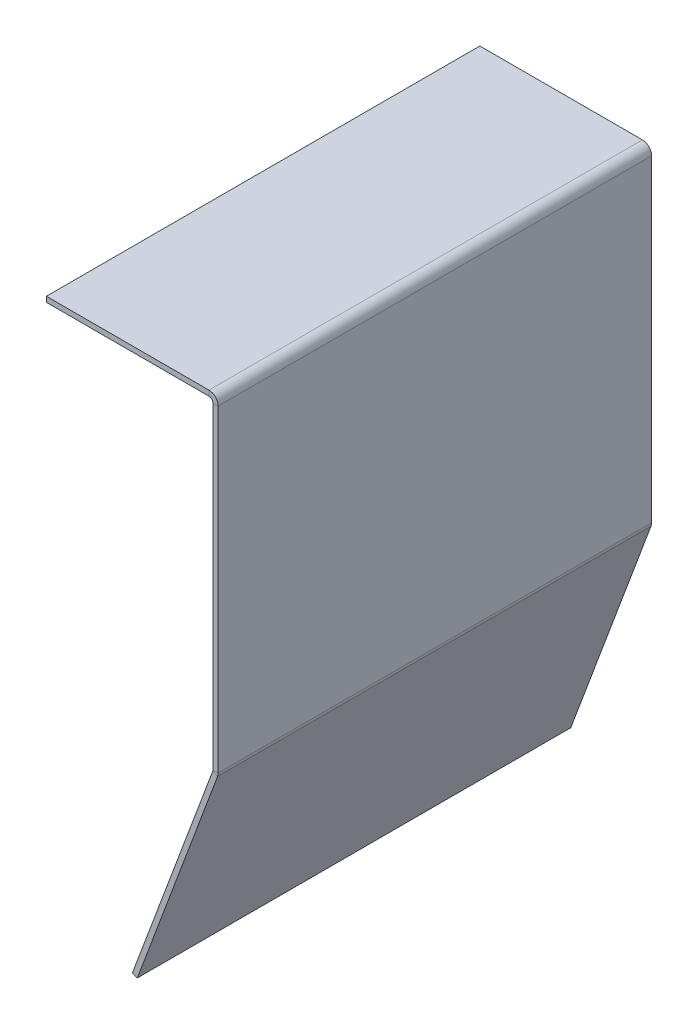
ISO-10303-21;
HEADER;
FILE_DESCRIPTION(('STEP AP214'),'2;1');
FILE_NAME('part.step','',(''),(''),'','','');
FILE_SCHEMA(('AUTOMOTIVE_DESIGN { 1 0 10303 214 1 1 1 1 }'));
ENDSEC;
DATA;
#1=APPLICATION_CONTEXT('core data for automotive mechanical design processes');
#2=APPLICATION_PROTOCOL_DEFINITION('international standard','automotive_design',2000,#1);
#3=PRODUCT_CONTEXT('',#1,'mechanical');
#4=PRODUCT('Part','Part','',(#3));
#5=PRODUCT_RELATED_PRODUCT_CATEGORY('part','',(#4));
#6=PRODUCT_DEFINITION_FORMATION('','',#4);
#7=PRODUCT_DEFINITION_CONTEXT('part definition',#1,'design');
#8=PRODUCT_DEFINITION('design','',#6,#7);
#9=PRODUCT_DEFINITION_SHAPE('','',#8);
#10=(LENGTH_UNIT() NAMED_UNIT(*) SI_UNIT(.MILLI.,.METRE.));
#11=(NAMED_UNIT(*) PLANE_ANGLE_UNIT() SI_UNIT($,.RADIAN.));
#12=(NAMED_UNIT(*) SI_UNIT($,.STERADIAN.) SOLID_ANGLE_UNIT());
#13=UNCERTAINTY_MEASURE_WITH_UNIT(LENGTH_MEASURE(1.E-05),#10,'distance_accuracy_value','');
#14=(GEOMETRIC_REPRESENTATION_CONTEXT(3) GLOBAL_UNCERTAINTY_ASSIGNED_CONTEXT((#13)) GLOBAL_UNIT_ASSIGNED_CONTEXT((#10,
#11,#12)) REPRESENTATION_CONTEXT('',''));
#15=CARTESIAN_POINT('',(0.,0.,0.));
#16=DIRECTION('',(0.,0.,1.));
#17=DIRECTION('',(1.,0.,0.));
#18=AXIS2_PLACEMENT_3D('',#15,#16,#17);
#19=CARTESIAN_POINT('',(0.,0.271244186189906,164.));
#20=DIRECTION('',(0.,0.,1.));
#21=DIRECTION('',(1.,0.,0.));
#22=AXIS2_PLACEMENT_3D('',#19,#20,#21);
#23=PLANE('',#22);
#24=DIRECTION('',(1.,0.,0.));
#25=VECTOR('',#24,1.);
#26=CARTESIAN_POINT('',(0.,0.271244186189906,164.));
#27=LINE('',#26,#25);
#28=CARTESIAN_POINT('',(0.,0.271244186189906,164.));
#29=VERTEX_POINT('',#28);
#30=CARTESIAN_POINT('',(2.,0.271244186189906,164.));
#31=VERTEX_POINT('',#30);
#32=EDGE_CURVE('E11',#29,#31,#27,.T.);
#33=ORIENTED_EDGE('',*,*,#32,.F.);
#34=CARTESIAN_POINT('',(-1.49999999999999,0.271244186189906,164.));
#35=DIRECTION('',(0.,0.,-1.));
#36=DIRECTION('',(-1.,0.,0.));
#37=AXIS2_PLACEMENT_3D('',#34,#35,#36);
#38=CIRCLE('',#37,1.5);
#39=CARTESIAN_POINT('',(-0.0949917161273857,-0.254066885699303,164.));
#40=VERTEX_POINT('',#39);
#41=EDGE_CURVE('E244',#40,#29,#38,.F.);
#42=ORIENTED_EDGE('',*,*,#41,.F.);
#43=DIRECTION('',(-0.936672189248396,0.350207381259471,0.));
#44=VECTOR('',#43,1.);
#45=CARTESIAN_POINT('',(1.7783526623694,-0.954481648218242,164.));
#46=LINE('',#45,#44);
#47=CARTESIAN_POINT('',(1.7783526623694,-0.954481648218242,164.));
#48=VERTEX_POINT('',#47);
#49=EDGE_CURVE('E42',#48,#40,#46,.T.);
#50=ORIENTED_EDGE('',*,*,#49,.F.);
#51=CARTESIAN_POINT('',(-1.49999999999999,0.271244186189906,164.));
#52=DIRECTION('',(0.,0.,1.));
#53=DIRECTION('',(1.,0.,0.));
#54=AXIS2_PLACEMENT_3D('',#51,#52,#53);
#55=CIRCLE('',#54,3.5);
#56=EDGE_CURVE('E143',#48,#31,#55,.T.);
#57=ORIENTED_EDGE('',*,*,#56,.T.);
#58=EDGE_LOOP('',(#33,#42,#50,#57));
#59=FACE_BOUND('',#58,.T.);
#60=ADVANCED_FACE('F34',(#59),#23,.T.);
#61=CARTESIAN_POINT('',(1.7783526623694,-0.954481648218242,164.));
#62=DIRECTION('',(0.,0.,1.));
#63=DIRECTION('',(1.,0.,0.));
#64=AXIS2_PLACEMENT_3D('',#61,#62,#63);
#65=PLANE('',#64);
#66=DIRECTION('',(0.,1.,0.));
#67=VECTOR('',#66,1.);
#68=CARTESIAN_POINT('',(0.,0.,164.));
#69=LINE('',#68,#67);
#70=CARTESIAN_POINT('',(0.,120.5,164.));
#71=VERTEX_POINT('',#70);
#72=EDGE_CURVE('E137',#29,#71,#69,.T.);
#73=ORIENTED_EDGE('',*,*,#72,.F.);
#74=ORIENTED_EDGE('',*,*,#32,.T.);
#75=DIRECTION('',(0.,1.,0.));
#76=VECTOR('',#75,1.);
#77=CARTESIAN_POINT('',(2.,0.,164.));
#78=LINE('',#77,#76);
#79=CARTESIAN_POINT('',(2.,120.5,164.));
#80=VERTEX_POINT('',#79);
#81=EDGE_CURVE('E134',#31,#80,#78,.T.);
#82=ORIENTED_EDGE('',*,*,#81,.T.);
#83=DIRECTION('',(-1.,0.,0.));
#84=VECTOR('',#83,1.);
#85=CARTESIAN_POINT('',(2.,120.5,164.));
#86=LINE('',#85,#84);
#87=EDGE_CURVE('E225',#80,#71,#86,.T.);
#88=ORIENTED_EDGE('',*,*,#87,.T.);
#89=EDGE_LOOP('',(#73,#74,#82,#88));
#90=FACE_BOUND('',#89,.T.);
#91=ADVANCED_FACE('F132',(#90),#65,.T.);
#92=CARTESIAN_POINT('',(-0.0949917161273857,-0.254066885699303,0.));
#93=DIRECTION('',(0.,0.,-1.));
#94=DIRECTION('',(-1.,0.,0.));
#95=AXIS2_PLACEMENT_3D('',#92,#93,#94);
#96=PLANE('',#95);
#97=DIRECTION('',(0.936672189248396,-0.350207381259471,0.));
#98=VECTOR('',#97,1.);
#99=CARTESIAN_POINT('',(-0.0949917161273857,-0.254066885699303,0.));
#100=LINE('',#99,#98);
#101=CARTESIAN_POINT('',(-0.0949917161273857,-0.254066885699303,0.));
#102=VERTEX_POINT('',#101);
#103=CARTESIAN_POINT('',(1.7783526623694,-0.954481648218242,0.));
#104=VERTEX_POINT('',#103);
#105=EDGE_CURVE('E230',#102,#104,#100,.T.);
#106=ORIENTED_EDGE('',*,*,#105,.F.);
#107=CARTESIAN_POINT('',(-1.49999999999999,0.271244186189906,0.));
#108=DIRECTION('',(0.,0.,-1.));
#109=DIRECTION('',(-1.,0.,0.));
#110=AXIS2_PLACEMENT_3D('',#107,#108,#109);
#111=CIRCLE('',#110,1.5);
#112=CARTESIAN_POINT('',(0.,0.271244186189906,0.));
#113=VERTEX_POINT('',#112);
#114=EDGE_CURVE('E182',#102,#113,#111,.F.);
#115=ORIENTED_EDGE('',*,*,#114,.T.);
#116=DIRECTION('',(-1.,0.,0.));
#117=VECTOR('',#116,1.);
#118=CARTESIAN_POINT('',(2.,0.271244186189906,0.));
#119=LINE('',#118,#117);
#120=CARTESIAN_POINT('',(2.,0.271244186189906,0.));
#121=VERTEX_POINT('',#120);
#122=EDGE_CURVE('E228',#121,#113,#119,.T.);
#123=ORIENTED_EDGE('',*,*,#122,.F.);
#124=CARTESIAN_POINT('',(-1.49999999999999,0.271244186189906,0.));
#125=DIRECTION('',(0.,0.,1.));
#126=DIRECTION('',(1.,0.,0.));
#127=AXIS2_PLACEMENT_3D('',#124,#125,#126);
#128=CIRCLE('',#127,3.5);
#129=EDGE_CURVE('E155',#104,#121,#128,.T.);
#130=ORIENTED_EDGE('',*,*,#129,.F.);
#131=EDGE_LOOP('',(#106,#115,#123,#130));
#132=FACE_BOUND('',#131,.T.);
#133=ADVANCED_FACE('F282',(#132),#96,.T.);
#134=CARTESIAN_POINT('',(2.,0.271244186189906,0.));
#135=DIRECTION('',(0.,0.,-1.));
#136=DIRECTION('',(-1.,0.,0.));
#137=AXIS2_PLACEMENT_3D('',#134,#135,#136);
#138=PLANE('',#137);
#139=DIRECTION('',(0.350207381259468,0.936672189248397,0.));
#140=VECTOR('',#139,1.);
#141=CARTESIAN_POINT('',(-30.4680421695737,-81.4904804646106,0.));
#142=LINE('',#141,#140);
#143=CARTESIAN_POINT('',(-30.4680421695737,-81.4904804646106,0.));
#144=VERTEX_POINT('',#143);
#145=EDGE_CURVE('E185',#144,#102,#142,.T.);
#146=ORIENTED_EDGE('',*,*,#145,.T.);
#147=ORIENTED_EDGE('',*,*,#105,.T.);
#148=DIRECTION('',(0.350207381259468,0.936672189248397,0.));
#149=VECTOR('',#148,1.);
#150=CARTESIAN_POINT('',(-28.5946977910769,-82.1908952271295,0.));
#151=LINE('',#150,#149);
#152=CARTESIAN_POINT('',(-28.5946977910769,-82.1908952271295,0.));
#153=VERTEX_POINT('',#152);
#154=EDGE_CURVE('E191',#153,#104,#151,.T.);
#155=ORIENTED_EDGE('',*,*,#154,.F.);
#156=DIRECTION('',(-0.936672189248398,0.350207381259467,0.));
#157=VECTOR('',#156,1.);
#158=CARTESIAN_POINT('',(-28.5946977910769,-82.1908952271295,0.));
#159=LINE('',#158,#157);
#160=EDGE_CURVE('E188',#153,#144,#159,.T.);
#161=ORIENTED_EDGE('',*,*,#160,.T.);
#162=EDGE_LOOP('',(#146,#147,#155,#161));
#163=FACE_BOUND('',#162,.T.);
#164=ADVANCED_FACE('F285',(#163),#138,.T.);
#165=CARTESIAN_POINT('',(-1.5,122.,164.));
#166=DIRECTION('',(0.,0.,1.));
#167=DIRECTION('',(1.,0.,0.));
#168=AXIS2_PLACEMENT_3D('',#165,#166,#167);
#169=PLANE('',#168);
#170=DIRECTION('',(0.,1.,0.));
#171=VECTOR('',#170,1.);
#172=CARTESIAN_POINT('',(-1.5,122.,164.));
#173=LINE('',#172,#171);
#174=CARTESIAN_POINT('',(-1.5,122.,164.));
#175=VERTEX_POINT('',#174);
#176=CARTESIAN_POINT('',(-1.5,124.,164.));
#177=VERTEX_POINT('',#176);
#178=EDGE_CURVE('E50',#175,#177,#173,.T.);
#179=ORIENTED_EDGE('',*,*,#178,.F.);
#180=CARTESIAN_POINT('',(-1.5,120.5,164.));
#181=DIRECTION('',(0.,0.,-1.));
#182=DIRECTION('',(-1.,0.,0.));
#183=AXIS2_PLACEMENT_3D('',#180,#181,#182);
#184=CIRCLE('',#183,1.5);
#185=EDGE_CURVE('E254',#71,#175,#184,.F.);
#186=ORIENTED_EDGE('',*,*,#185,.F.);
#187=ORIENTED_EDGE('',*,*,#87,.F.);
#188=CARTESIAN_POINT('',(-1.5,120.5,164.));
#189=DIRECTION('',(0.,0.,1.));
#190=DIRECTION('',(1.,0.,0.));
#191=AXIS2_PLACEMENT_3D('',#188,#189,#190);
#192=CIRCLE('',#191,3.5);
#193=EDGE_CURVE('E163',#80,#177,#192,.T.);
#194=ORIENTED_EDGE('',*,*,#193,.T.);
#195=EDGE_LOOP('',(#179,#186,#187,#194));
#196=FACE_BOUND('',#195,.T.);
#197=ADVANCED_FACE('F277',(#196),#169,.T.);
#198=CARTESIAN_POINT('',(2.,120.5,164.));
#199=DIRECTION('',(0.,0.,1.));
#200=DIRECTION('',(1.,0.,0.));
#201=AXIS2_PLACEMENT_3D('',#198,#199,#200);
#202=PLANE('',#201);
#203=DIRECTION('',(-1.,0.,0.));
#204=VECTOR('',#203,1.);
#205=CARTESIAN_POINT('',(0.,122.,164.));
#206=LINE('',#205,#204);
#207=CARTESIAN_POINT('',(-63.,122.,164.));
#208=VERTEX_POINT('',#207);
#209=EDGE_CURVE('E257',#175,#208,#206,.T.);
#210=ORIENTED_EDGE('',*,*,#209,.F.);
#211=ORIENTED_EDGE('',*,*,#178,.T.);
#212=DIRECTION('',(-1.,0.,0.));
#213=VECTOR('',#212,1.);
#214=CARTESIAN_POINT('',(0.,124.,164.));
#215=LINE('',#214,#213);
#216=CARTESIAN_POINT('',(-63.,124.,164.));
#217=VERTEX_POINT('',#216);
#218=EDGE_CURVE('E104',#177,#217,#215,.T.);
#219=ORIENTED_EDGE('',*,*,#218,.T.);
#220=DIRECTION('',(0.,1.,0.));
#221=VECTOR('',#220,1.);
#222=CARTESIAN_POINT('',(-63.,122.,164.));
#223=LINE('',#222,#221);
#224=EDGE_CURVE('E260',#208,#217,#223,.T.);
#225=ORIENTED_EDGE('',*,*,#224,.F.);
#226=EDGE_LOOP('',(#210,#211,#219,#225));
#227=FACE_BOUND('',#226,.T.);
#228=ADVANCED_FACE('F266',(#227),#202,.T.);
#229=CARTESIAN_POINT('',(0.,120.5,0.));
#230=DIRECTION('',(0.,0.,-1.));
#231=DIRECTION('',(-1.,0.,0.));
#232=AXIS2_PLACEMENT_3D('',#229,#230,#231);
#233=PLANE('',#232);
#234=DIRECTION('',(1.,0.,0.));
#235=VECTOR('',#234,1.);
#236=CARTESIAN_POINT('',(0.,120.5,0.));
#237=LINE('',#236,#235);
#238=CARTESIAN_POINT('',(0.,120.5,0.));
#239=VERTEX_POINT('',#238);
#240=CARTESIAN_POINT('',(2.,120.5,0.));
#241=VERTEX_POINT('',#240);
#242=EDGE_CURVE('E91',#239,#241,#237,.T.);
#243=ORIENTED_EDGE('',*,*,#242,.F.);
#244=CARTESIAN_POINT('',(-1.5,120.5,0.));
#245=DIRECTION('',(0.,0.,-1.));
#246=DIRECTION('',(-1.,0.,0.));
#247=AXIS2_PLACEMENT_3D('',#244,#245,#246);
#248=CIRCLE('',#247,1.5);
#249=CARTESIAN_POINT('',(-1.5,122.,0.));
#250=VERTEX_POINT('',#249);
#251=EDGE_CURVE('E178',#239,#250,#248,.F.);
#252=ORIENTED_EDGE('',*,*,#251,.T.);
#253=DIRECTION('',(0.,-1.,0.));
#254=VECTOR('',#253,1.);
#255=CARTESIAN_POINT('',(-1.5,124.,0.));
#256=LINE('',#255,#254);
#257=CARTESIAN_POINT('',(-1.5,124.,0.));
#258=VERTEX_POINT('',#257);
#259=EDGE_CURVE('E98',#258,#250,#256,.T.);
#260=ORIENTED_EDGE('',*,*,#259,.F.);
#261=CARTESIAN_POINT('',(-1.5,120.5,0.));
#262=DIRECTION('',(0.,0.,1.));
#263=DIRECTION('',(1.,0.,0.));
#264=AXIS2_PLACEMENT_3D('',#261,#262,#263);
#265=CIRCLE('',#264,3.5);
#266=EDGE_CURVE('E197',#241,#258,#265,.T.);
#267=ORIENTED_EDGE('',*,*,#266,.F.);
#268=EDGE_LOOP('',(#243,#252,#260,#267));
#269=FACE_BOUND('',#268,.T.);
#270=ADVANCED_FACE('F314',(#269),#233,.T.);
#271=CARTESIAN_POINT('',(-1.5,124.,0.));
#272=DIRECTION('',(0.,0.,-1.));
#273=DIRECTION('',(-1.,0.,0.));
#274=AXIS2_PLACEMENT_3D('',#271,#272,#273);
#275=PLANE('',#274);
#276=DIRECTION('',(0.,1.,0.));
#277=VECTOR('',#276,1.);
#278=CARTESIAN_POINT('',(0.,0.,0.));
#279=LINE('',#278,#277);
#280=EDGE_CURVE('E180',#113,#239,#279,.T.);
#281=ORIENTED_EDGE('',*,*,#280,.T.);
#282=ORIENTED_EDGE('',*,*,#242,.T.);
#283=DIRECTION('',(0.,1.,0.));
#284=VECTOR('',#283,1.);
#285=CARTESIAN_POINT('',(2.,0.,0.));
#286=LINE('',#285,#284);
#287=EDGE_CURVE('E195',#121,#241,#286,.T.);
#288=ORIENTED_EDGE('',*,*,#287,.F.);
#289=ORIENTED_EDGE('',*,*,#122,.T.);
#290=EDGE_LOOP('',(#281,#282,#288,#289));
#291=FACE_BOUND('',#290,.T.);
#292=ADVANCED_FACE('F317',(#291),#275,.T.);
#293=CARTESIAN_POINT('',(0.,124.,164.));
#294=DIRECTION('',(0.,-1.,0.));
#295=DIRECTION('',(1.,0.,0.));
#296=AXIS2_PLACEMENT_3D('',#293,#294,#295);
#297=PLANE('',#296);
#298=DIRECTION('',(-1.,0.,0.));
#299=VECTOR('',#298,1.);
#300=CARTESIAN_POINT('',(0.,124.,0.));
#301=LINE('',#300,#299);
#302=CARTESIAN_POINT('',(-63.,124.,0.));
#303=VERTEX_POINT('',#302);
#304=EDGE_CURVE('E169',#258,#303,#301,.T.);
#305=ORIENTED_EDGE('',*,*,#304,.T.);
#306=DIRECTION('',(0.,0.,-1.));
#307=VECTOR('',#306,1.);
#308=CARTESIAN_POINT('',(-63.,124.,164.));
#309=LINE('',#308,#307);
#310=EDGE_CURVE('E221',#217,#303,#309,.T.);
#311=ORIENTED_EDGE('',*,*,#310,.F.);
#312=ORIENTED_EDGE('',*,*,#218,.F.);
#313=DIRECTION('',(0.,0.,-1.));
#314=VECTOR('',#313,1.);
#315=CARTESIAN_POINT('',(-1.5,124.,164.));
#316=LINE('',#315,#314);
#317=EDGE_CURVE('E165',#177,#258,#316,.T.);
#318=ORIENTED_EDGE('',*,*,#317,.T.);
#319=EDGE_LOOP('',(#305,#311,#312,#318));
#320=FACE_BOUND('',#319,.T.);
#321=ADVANCED_FACE('F320',(#320),#297,.F.);
#322=CARTESIAN_POINT('',(-63.,122.,164.));
#323=DIRECTION('',(-1.,0.,0.));
#324=DIRECTION('',(0.,0.,1.));
#325=AXIS2_PLACEMENT_3D('',#322,#323,#324);
#326=PLANE('',#325);
#327=DIRECTION('',(0.,1.,0.));
#328=VECTOR('',#327,1.);
#329=CARTESIAN_POINT('',(-63.,122.,0.));
#330=LINE('',#329,#328);
#331=CARTESIAN_POINT('',(-63.,122.,0.));
#332=VERTEX_POINT('',#331);
#333=EDGE_CURVE('E172',#332,#303,#330,.T.);
#334=ORIENTED_EDGE('',*,*,#333,.F.);
#335=DIRECTION('',(0.,0.,-1.));
#336=VECTOR('',#335,1.);
#337=CARTESIAN_POINT('',(-63.,122.,164.));
#338=LINE('',#337,#336);
#339=EDGE_CURVE('E219',#208,#332,#338,.T.);
#340=ORIENTED_EDGE('',*,*,#339,.F.);
#341=ORIENTED_EDGE('',*,*,#224,.T.);
#342=ORIENTED_EDGE('',*,*,#310,.T.);
#343=EDGE_LOOP('',(#334,#340,#341,#342));
#344=FACE_BOUND('',#343,.T.);
#345=ADVANCED_FACE('F265',(#344),#326,.T.);
#346=CARTESIAN_POINT('',(0.,122.,164.));
#347=DIRECTION('',(0.,-1.,0.));
#348=DIRECTION('',(1.,0.,0.));
#349=AXIS2_PLACEMENT_3D('',#346,#347,#348);
#350=PLANE('',#349);
#351=DIRECTION('',(-1.,0.,0.));
#352=VECTOR('',#351,1.);
#353=CARTESIAN_POINT('',(0.,122.,0.));
#354=LINE('',#353,#352);
#355=EDGE_CURVE('E175',#250,#332,#354,.T.);
#356=ORIENTED_EDGE('',*,*,#355,.F.);
#357=DIRECTION('',(0.,0.,-1.));
#358=VECTOR('',#357,1.);
#359=CARTESIAN_POINT('',(-1.5,122.,164.));
#360=LINE('',#359,#358);
#361=EDGE_CURVE('E216',#175,#250,#360,.T.);
#362=ORIENTED_EDGE('',*,*,#361,.F.);
#363=ORIENTED_EDGE('',*,*,#209,.T.);
#364=ORIENTED_EDGE('',*,*,#339,.T.);
#365=EDGE_LOOP('',(#356,#362,#363,#364));
#366=FACE_BOUND('',#365,.T.);
#367=ADVANCED_FACE('F270',(#366),#350,.T.);
#368=CARTESIAN_POINT('',(-1.5,120.5,164.));
#369=DIRECTION('',(0.,0.,-1.));
#370=DIRECTION('',(-1.,0.,0.));
#371=AXIS2_PLACEMENT_3D('',#368,#369,#370);
#372=CYLINDRICAL_SURFACE('',#371,1.5);
#373=ORIENTED_EDGE('',*,*,#251,.F.);
#374=DIRECTION('',(0.,0.,-1.));
#375=VECTOR('',#374,1.);
#376=CARTESIAN_POINT('',(0.,120.5,164.));
#377=LINE('',#376,#375);
#378=EDGE_CURVE('E213',#71,#239,#377,.T.);
#379=ORIENTED_EDGE('',*,*,#378,.F.);
#380=ORIENTED_EDGE('',*,*,#185,.T.);
#381=ORIENTED_EDGE('',*,*,#361,.T.);
#382=EDGE_LOOP('',(#373,#379,#380,#381));
#383=FACE_BOUND('',#382,.T.);
#384=ADVANCED_FACE('F273',(#383),#372,.F.);
#385=CARTESIAN_POINT('',(0.,0.,164.));
#386=DIRECTION('',(-1.,0.,0.));
#387=DIRECTION('',(0.,0.,1.));
#388=AXIS2_PLACEMENT_3D('',#385,#386,#387);
#389=PLANE('',#388);
#390=ORIENTED_EDGE('',*,*,#280,.F.);
#391=DIRECTION('',(0.,0.,-1.));
#392=VECTOR('',#391,1.);
#393=CARTESIAN_POINT('',(0.,0.271244186189906,164.));
#394=LINE('',#393,#392);
#395=EDGE_CURVE('E210',#29,#113,#394,.T.);
#396=ORIENTED_EDGE('',*,*,#395,.F.);
#397=ORIENTED_EDGE('',*,*,#72,.T.);
#398=ORIENTED_EDGE('',*,*,#378,.T.);
#399=EDGE_LOOP('',(#390,#396,#397,#398));
#400=FACE_BOUND('',#399,.T.);
#401=ADVANCED_FACE('F280',(#400),#389,.T.);
#402=CARTESIAN_POINT('',(-1.49999999999999,0.271244186189906,164.));
#403=DIRECTION('',(0.,0.,-1.));
#404=DIRECTION('',(-1.,0.,0.));
#405=AXIS2_PLACEMENT_3D('',#402,#403,#404);
#406=CYLINDRICAL_SURFACE('',#405,1.5);
#407=ORIENTED_EDGE('',*,*,#114,.F.);
#408=DIRECTION('',(0.,0.,-1.));
#409=VECTOR('',#408,1.);
#410=CARTESIAN_POINT('',(-0.0949917161273857,-0.254066885699303,164.));
#411=LINE('',#410,#409);
#412=EDGE_CURVE('E207',#40,#102,#411,.T.);
#413=ORIENTED_EDGE('',*,*,#412,.F.);
#414=ORIENTED_EDGE('',*,*,#41,.T.);
#415=ORIENTED_EDGE('',*,*,#395,.T.);
#416=EDGE_LOOP('',(#407,#413,#414,#415));
#417=FACE_BOUND('',#416,.T.);
#418=ADVANCED_FACE('F243',(#417),#406,.F.);
#419=CARTESIAN_POINT('',(-30.4680421695737,-81.4904804646106,164.));
#420=DIRECTION('',(-0.936672189248397,0.350207381259468,0.));
#421=DIRECTION('',(-0.350207381259468,-0.936672189248397,0.));
#422=AXIS2_PLACEMENT_3D('',#419,#420,#421);
#423=PLANE('',#422);
#424=ORIENTED_EDGE('',*,*,#145,.F.);
#425=DIRECTION('',(0.,0.,-1.));
#426=VECTOR('',#425,1.);
#427=CARTESIAN_POINT('',(-30.4680421695737,-81.4904804646106,164.));
#428=LINE('',#427,#426);
#429=CARTESIAN_POINT('',(-30.4680421695737,-81.4904804646106,164.));
#430=VERTEX_POINT('',#429);
#431=EDGE_CURVE('E205',#430,#144,#428,.T.);
#432=ORIENTED_EDGE('',*,*,#431,.F.);
#433=DIRECTION('',(0.350207381259468,0.936672189248397,0.));
#434=VECTOR('',#433,1.);
#435=CARTESIAN_POINT('',(-30.4680421695737,-81.4904804646106,164.));
#436=LINE('',#435,#434);
#437=EDGE_CURVE('E237',#430,#40,#436,.T.);
#438=ORIENTED_EDGE('',*,*,#437,.T.);
#439=ORIENTED_EDGE('',*,*,#412,.T.);
#440=EDGE_LOOP('',(#424,#432,#438,#439));
#441=FACE_BOUND('',#440,.T.);
#442=ADVANCED_FACE('F248',(#441),#423,.T.);
#443=CARTESIAN_POINT('',(-28.5946977910769,-82.1908952271295,164.));
#444=DIRECTION('',(-0.350207381259467,-0.936672189248398,0.));
#445=DIRECTION('',(0.936672189248398,-0.350207381259467,0.));
#446=AXIS2_PLACEMENT_3D('',#443,#444,#445);
#447=PLANE('',#446);
#448=ORIENTED_EDGE('',*,*,#160,.F.);
#449=DIRECTION('',(0.,0.,-1.));
#450=VECTOR('',#449,1.);
#451=CARTESIAN_POINT('',(-28.5946977910769,-82.1908952271295,164.));
#452=LINE('',#451,#450);
#453=CARTESIAN_POINT('',(-28.5946977910769,-82.1908952271295,164.));
#454=VERTEX_POINT('',#453);
#455=EDGE_CURVE('E203',#454,#153,#452,.T.);
#456=ORIENTED_EDGE('',*,*,#455,.F.);
#457=DIRECTION('',(-0.936672189248398,0.350207381259467,0.));
#458=VECTOR('',#457,1.);
#459=CARTESIAN_POINT('',(-28.5946977910769,-82.1908952271295,164.));
#460=LINE('',#459,#458);
#461=EDGE_CURVE('E249',#454,#430,#460,.T.);
#462=ORIENTED_EDGE('',*,*,#461,.T.);
#463=ORIENTED_EDGE('',*,*,#431,.T.);
#464=EDGE_LOOP('',(#448,#456,#462,#463));
#465=FACE_BOUND('',#464,.T.);
#466=ADVANCED_FACE('F290',(#465),#447,.T.);
#467=CARTESIAN_POINT('',(-28.5946977910769,-82.1908952271295,164.));
#468=DIRECTION('',(-0.936672189248397,0.350207381259468,0.));
#469=DIRECTION('',(-0.350207381259468,-0.936672189248397,0.));
#470=AXIS2_PLACEMENT_3D('',#467,#468,#469);
#471=PLANE('',#470);
#472=ORIENTED_EDGE('',*,*,#154,.T.);
#473=DIRECTION('',(0.,0.,-1.));
#474=VECTOR('',#473,1.);
#475=CARTESIAN_POINT('',(1.7783526623694,-0.954481648218242,164.));
#476=LINE('',#475,#474);
#477=EDGE_CURVE('E157',#48,#104,#476,.T.);
#478=ORIENTED_EDGE('',*,*,#477,.F.);
#479=DIRECTION('',(0.350207381259468,0.936672189248397,0.));
#480=VECTOR('',#479,1.);
#481=CARTESIAN_POINT('',(-28.5946977910769,-82.1908952271295,164.));
#482=LINE('',#481,#480);
#483=EDGE_CURVE('E148',#454,#48,#482,.T.);
#484=ORIENTED_EDGE('',*,*,#483,.F.);
#485=ORIENTED_EDGE('',*,*,#455,.T.);
#486=EDGE_LOOP('',(#472,#478,#484,#485));
#487=FACE_BOUND('',#486,.T.);
#488=ADVANCED_FACE('F288',(#487),#471,.F.);
#489=CARTESIAN_POINT('',(-1.49999999999999,0.271244186189906,164.));
#490=DIRECTION('',(0.,0.,-1.));
#491=DIRECTION('',(-1.,0.,0.));
#492=AXIS2_PLACEMENT_3D('',#489,#490,#491);
#493=CYLINDRICAL_SURFACE('',#492,3.5);
#494=ORIENTED_EDGE('',*,*,#129,.T.);
#495=DIRECTION('',(0.,0.,-1.));
#496=VECTOR('',#495,1.);
#497=CARTESIAN_POINT('',(2.,0.271244186189906,164.));
#498=LINE('',#497,#496);
#499=EDGE_CURVE('E152',#31,#121,#498,.T.);
#500=ORIENTED_EDGE('',*,*,#499,.F.);
#501=ORIENTED_EDGE('',*,*,#56,.F.);
#502=ORIENTED_EDGE('',*,*,#477,.T.);
#503=EDGE_LOOP('',(#494,#500,#501,#502));
#504=FACE_BOUND('',#503,.T.);
#505=ADVANCED_FACE('F153',(#504),#493,.T.);
#506=CARTESIAN_POINT('',(2.,0.,164.));
#507=DIRECTION('',(-1.,0.,0.));
#508=DIRECTION('',(0.,0.,1.));
#509=AXIS2_PLACEMENT_3D('',#506,#507,#508);
#510=PLANE('',#509);
#511=ORIENTED_EDGE('',*,*,#287,.T.);
#512=DIRECTION('',(0.,0.,-1.));
#513=VECTOR('',#512,1.);
#514=CARTESIAN_POINT('',(2.,120.5,164.));
#515=LINE('',#514,#513);
#516=EDGE_CURVE('E158',#80,#241,#515,.T.);
#517=ORIENTED_EDGE('',*,*,#516,.F.);
#518=ORIENTED_EDGE('',*,*,#81,.F.);
#519=ORIENTED_EDGE('',*,*,#499,.T.);
#520=EDGE_LOOP('',(#511,#517,#518,#519));
#521=FACE_BOUND('',#520,.T.);
#522=ADVANCED_FACE('F160',(#521),#510,.F.);
#523=CARTESIAN_POINT('',(-1.5,120.5,164.));
#524=DIRECTION('',(0.,0.,-1.));
#525=DIRECTION('',(-1.,0.,0.));
#526=AXIS2_PLACEMENT_3D('',#523,#524,#525);
#527=CYLINDRICAL_SURFACE('',#526,3.5);
#528=ORIENTED_EDGE('',*,*,#266,.T.);
#529=ORIENTED_EDGE('',*,*,#317,.F.);
#530=ORIENTED_EDGE('',*,*,#193,.F.);
#531=ORIENTED_EDGE('',*,*,#516,.T.);
#532=EDGE_LOOP('',(#528,#529,#530,#531));
#533=FACE_BOUND('',#532,.T.);
#534=ADVANCED_FACE('F372',(#533),#527,.T.);
#535=CARTESIAN_POINT('',(-1.5,120.5,164.));
#536=DIRECTION('',(0.,0.,-1.));
#537=DIRECTION('',(-1.,0.,0.));
#538=AXIS2_PLACEMENT_3D('',#535,#536,#537);
#539=PLANE('',#538);
#540=ORIENTED_EDGE('',*,*,#483,.T.);
#541=ORIENTED_EDGE('',*,*,#49,.T.);
#542=ORIENTED_EDGE('',*,*,#437,.F.);
#543=ORIENTED_EDGE('',*,*,#461,.F.);
#544=EDGE_LOOP('',(#540,#541,#542,#543));
#545=FACE_BOUND('',#544,.T.);
#546=ADVANCED_FACE('F234',(#545),#539,.F.);
#547=CARTESIAN_POINT('',(-1.5,120.5,0.));
#548=DIRECTION('',(0.,0.,-1.));
#549=DIRECTION('',(-1.,0.,0.));
#550=AXIS2_PLACEMENT_3D('',#547,#548,#549);
#551=PLANE('',#550);
#552=ORIENTED_EDGE('',*,*,#304,.F.);
#553=ORIENTED_EDGE('',*,*,#259,.T.);
#554=ORIENTED_EDGE('',*,*,#355,.T.);
#555=ORIENTED_EDGE('',*,*,#333,.T.);
#556=EDGE_LOOP('',(#552,#553,#554,#555));
#557=FACE_BOUND('',#556,.T.);
#558=ADVANCED_FACE('F392',(#557),#551,.T.);
#559=CLOSED_SHELL('',(#60,#91,#133,#164,#197,#228,#270,#292,#321,#345,#367,#384,#401,#418,#442,
#466,#488,#505,#522,#534,#546,#558));
#560=MANIFOLD_SOLID_BREP('B2',#559);
#561=ADVANCED_BREP_SHAPE_REPRESENTATION('',(#18,#560),#14);
#562=SHAPE_DEFINITION_REPRESENTATION(#9,#561);
ENDSEC;
END-ISO-10303-21;
